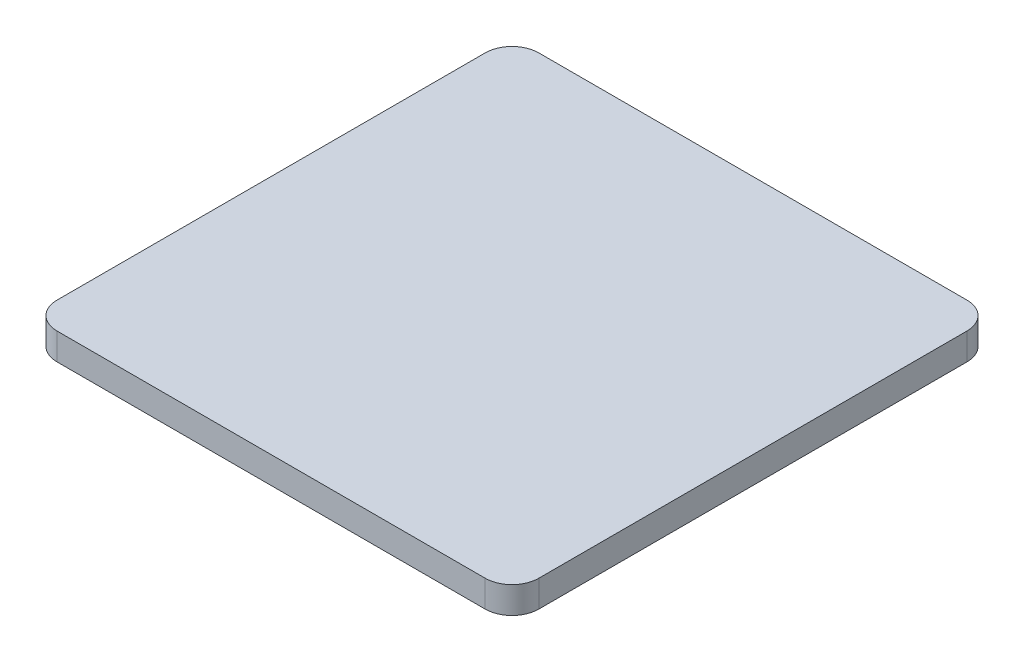
ISO-10303-21;
HEADER;
FILE_DESCRIPTION(('STEP AP214'),'2;1');
FILE_NAME('part.step','',(''),(''),'','','');
FILE_SCHEMA(('AUTOMOTIVE_DESIGN { 1 0 10303 214 1 1 1 1 }'));
ENDSEC;
DATA;
#1=APPLICATION_CONTEXT('core data for automotive mechanical design processes');
#2=APPLICATION_PROTOCOL_DEFINITION('international standard','automotive_design',2000,#1);
#3=PRODUCT_CONTEXT('',#1,'mechanical');
#4=PRODUCT('Part','Part','',(#3));
#5=PRODUCT_RELATED_PRODUCT_CATEGORY('part','',(#4));
#6=PRODUCT_DEFINITION_FORMATION('','',#4);
#7=PRODUCT_DEFINITION_CONTEXT('part definition',#1,'design');
#8=PRODUCT_DEFINITION('design','',#6,#7);
#9=PRODUCT_DEFINITION_SHAPE('','',#8);
#10=(LENGTH_UNIT() NAMED_UNIT(*) SI_UNIT(.MILLI.,.METRE.));
#11=(NAMED_UNIT(*) PLANE_ANGLE_UNIT() SI_UNIT($,.RADIAN.));
#12=(NAMED_UNIT(*) SI_UNIT($,.STERADIAN.) SOLID_ANGLE_UNIT());
#13=UNCERTAINTY_MEASURE_WITH_UNIT(LENGTH_MEASURE(1.E-05),#10,'distance_accuracy_value','');
#14=(GEOMETRIC_REPRESENTATION_CONTEXT(3) GLOBAL_UNCERTAINTY_ASSIGNED_CONTEXT((#13)) GLOBAL_UNIT_ASSIGNED_CONTEXT((#10,
#11,#12)) REPRESENTATION_CONTEXT('',''));
#15=CARTESIAN_POINT('',(0.,0.,0.));
#16=DIRECTION('',(0.,0.,1.));
#17=DIRECTION('',(1.,0.,0.));
#18=AXIS2_PLACEMENT_3D('',#15,#16,#17);
#19=CARTESIAN_POINT('',(-80.,10.,80.));
#20=DIRECTION('',(0.,-1.,0.));
#21=DIRECTION('',(0.,0.,-1.));
#22=AXIS2_PLACEMENT_3D('',#19,#20,#21);
#23=CYLINDRICAL_SURFACE('',#22,9.99999999999999);
#24=CARTESIAN_POINT('',(-80.,0.,80.));
#25=DIRECTION('',(0.,1.,0.));
#26=DIRECTION('',(0.,0.,-1.));
#27=AXIS2_PLACEMENT_3D('',#24,#25,#26);
#28=CIRCLE('',#27,9.99999999999999);
#29=CARTESIAN_POINT('',(-90.,0.,80.));
#30=VERTEX_POINT('',#29);
#31=CARTESIAN_POINT('',(-80.,0.,90.));
#32=VERTEX_POINT('',#31);
#33=EDGE_CURVE('E135',#30,#32,#28,.T.);
#34=ORIENTED_EDGE('',*,*,#33,.T.);
#35=DIRECTION('',(0.,-1.,0.));
#36=VECTOR('',#35,1.);
#37=CARTESIAN_POINT('',(-80.,10.,90.));
#38=LINE('',#37,#36);
#39=CARTESIAN_POINT('',(-80.,10.,90.));
#40=VERTEX_POINT('',#39);
#41=EDGE_CURVE('E11',#40,#32,#38,.T.);
#42=ORIENTED_EDGE('',*,*,#41,.F.);
#43=CARTESIAN_POINT('',(-80.,10.,80.));
#44=DIRECTION('',(0.,1.,0.));
#45=DIRECTION('',(0.,0.,-1.));
#46=AXIS2_PLACEMENT_3D('',#43,#44,#45);
#47=CIRCLE('',#46,9.99999999999999);
#48=CARTESIAN_POINT('',(-90.,10.,80.));
#49=VERTEX_POINT('',#48);
#50=EDGE_CURVE('E149',#49,#40,#47,.T.);
#51=ORIENTED_EDGE('',*,*,#50,.F.);
#52=DIRECTION('',(0.,-1.,0.));
#53=VECTOR('',#52,1.);
#54=CARTESIAN_POINT('',(-90.,10.,80.));
#55=LINE('',#54,#53);
#56=EDGE_CURVE('E131',#49,#30,#55,.T.);
#57=ORIENTED_EDGE('',*,*,#56,.T.);
#58=EDGE_LOOP('',(#34,#42,#51,#57));
#59=FACE_BOUND('',#58,.T.);
#60=ADVANCED_FACE('F39',(#59),#23,.T.);
#61=CARTESIAN_POINT('',(-80.,10.,90.));
#62=DIRECTION('',(0.,0.,-1.));
#63=DIRECTION('',(-1.,0.,0.));
#64=AXIS2_PLACEMENT_3D('',#61,#62,#63);
#65=PLANE('',#64);
#66=DIRECTION('',(1.,0.,0.));
#67=VECTOR('',#66,1.);
#68=CARTESIAN_POINT('',(-80.,0.,90.));
#69=LINE('',#68,#67);
#70=CARTESIAN_POINT('',(80.,0.,90.));
#71=VERTEX_POINT('',#70);
#72=EDGE_CURVE('E138',#32,#71,#69,.T.);
#73=ORIENTED_EDGE('',*,*,#72,.T.);
#74=DIRECTION('',(0.,-1.,0.));
#75=VECTOR('',#74,1.);
#76=CARTESIAN_POINT('',(80.,10.,90.));
#77=LINE('',#76,#75);
#78=CARTESIAN_POINT('',(80.,10.,90.));
#79=VERTEX_POINT('',#78);
#80=EDGE_CURVE('E47',#79,#71,#77,.T.);
#81=ORIENTED_EDGE('',*,*,#80,.F.);
#82=DIRECTION('',(1.,0.,0.));
#83=VECTOR('',#82,1.);
#84=CARTESIAN_POINT('',(-80.,10.,90.));
#85=LINE('',#84,#83);
#86=EDGE_CURVE('E98',#40,#79,#85,.T.);
#87=ORIENTED_EDGE('',*,*,#86,.F.);
#88=ORIENTED_EDGE('',*,*,#41,.T.);
#89=EDGE_LOOP('',(#73,#81,#87,#88));
#90=FACE_BOUND('',#89,.T.);
#91=ADVANCED_FACE('F184',(#90),#65,.F.);
#92=CARTESIAN_POINT('',(80.,10.,80.));
#93=DIRECTION('',(0.,-1.,0.));
#94=DIRECTION('',(0.,0.,-1.));
#95=AXIS2_PLACEMENT_3D('',#92,#93,#94);
#96=CYLINDRICAL_SURFACE('',#95,9.99999999999999);
#97=CARTESIAN_POINT('',(80.,0.,80.));
#98=DIRECTION('',(0.,1.,0.));
#99=DIRECTION('',(0.,0.,1.));
#100=AXIS2_PLACEMENT_3D('',#97,#98,#99);
#101=CIRCLE('',#100,9.99999999999999);
#102=CARTESIAN_POINT('',(90.,0.,80.));
#103=VERTEX_POINT('',#102);
#104=EDGE_CURVE('E140',#71,#103,#101,.T.);
#105=ORIENTED_EDGE('',*,*,#104,.T.);
#106=DIRECTION('',(0.,-1.,0.));
#107=VECTOR('',#106,1.);
#108=CARTESIAN_POINT('',(90.,10.,80.));
#109=LINE('',#108,#107);
#110=CARTESIAN_POINT('',(90.,10.,80.));
#111=VERTEX_POINT('',#110);
#112=EDGE_CURVE('E156',#111,#103,#109,.T.);
#113=ORIENTED_EDGE('',*,*,#112,.F.);
#114=CARTESIAN_POINT('',(80.,10.,80.));
#115=DIRECTION('',(0.,1.,0.));
#116=DIRECTION('',(0.,0.,1.));
#117=AXIS2_PLACEMENT_3D('',#114,#115,#116);
#118=CIRCLE('',#117,9.99999999999999);
#119=EDGE_CURVE('E164',#79,#111,#118,.T.);
#120=ORIENTED_EDGE('',*,*,#119,.F.);
#121=ORIENTED_EDGE('',*,*,#80,.T.);
#122=EDGE_LOOP('',(#105,#113,#120,#121));
#123=FACE_BOUND('',#122,.T.);
#124=ADVANCED_FACE('F162',(#123),#96,.T.);
#125=CARTESIAN_POINT('',(90.,10.,80.));
#126=DIRECTION('',(-1.,0.,0.));
#127=DIRECTION('',(0.,0.,1.));
#128=AXIS2_PLACEMENT_3D('',#125,#126,#127);
#129=PLANE('',#128);
#130=DIRECTION('',(0.,0.,-1.));
#131=VECTOR('',#130,1.);
#132=CARTESIAN_POINT('',(90.,0.,80.));
#133=LINE('',#132,#131);
#134=CARTESIAN_POINT('',(90.,0.,-80.));
#135=VERTEX_POINT('',#134);
#136=EDGE_CURVE('E142',#103,#135,#133,.T.);
#137=ORIENTED_EDGE('',*,*,#136,.T.);
#138=DIRECTION('',(0.,-1.,0.));
#139=VECTOR('',#138,1.);
#140=CARTESIAN_POINT('',(90.,10.,-80.));
#141=LINE('',#140,#139);
#142=CARTESIAN_POINT('',(90.,10.,-80.));
#143=VERTEX_POINT('',#142);
#144=EDGE_CURVE('E153',#143,#135,#141,.T.);
#145=ORIENTED_EDGE('',*,*,#144,.F.);
#146=DIRECTION('',(0.,0.,-1.));
#147=VECTOR('',#146,1.);
#148=CARTESIAN_POINT('',(90.,10.,80.));
#149=LINE('',#148,#147);
#150=EDGE_CURVE('E176',#111,#143,#149,.T.);
#151=ORIENTED_EDGE('',*,*,#150,.F.);
#152=ORIENTED_EDGE('',*,*,#112,.T.);
#153=EDGE_LOOP('',(#137,#145,#151,#152));
#154=FACE_BOUND('',#153,.T.);
#155=ADVANCED_FACE('F172',(#154),#129,.F.);
#156=CARTESIAN_POINT('',(80.,10.,-80.));
#157=DIRECTION('',(0.,-1.,0.));
#158=DIRECTION('',(0.,0.,-1.));
#159=AXIS2_PLACEMENT_3D('',#156,#157,#158);
#160=CYLINDRICAL_SURFACE('',#159,9.99999999999999);
#161=CARTESIAN_POINT('',(80.,0.,-80.));
#162=DIRECTION('',(0.,1.,0.));
#163=DIRECTION('',(0.,0.,-1.));
#164=AXIS2_PLACEMENT_3D('',#161,#162,#163);
#165=CIRCLE('',#164,9.99999999999999);
#166=CARTESIAN_POINT('',(80.,0.,-90.));
#167=VERTEX_POINT('',#166);
#168=EDGE_CURVE('E144',#135,#167,#165,.T.);
#169=ORIENTED_EDGE('',*,*,#168,.T.);
#170=DIRECTION('',(0.,-1.,0.));
#171=VECTOR('',#170,1.);
#172=CARTESIAN_POINT('',(80.,10.,-90.));
#173=LINE('',#172,#171);
#174=CARTESIAN_POINT('',(80.,10.,-90.));
#175=VERTEX_POINT('',#174);
#176=EDGE_CURVE('E126',#175,#167,#173,.T.);
#177=ORIENTED_EDGE('',*,*,#176,.F.);
#178=CARTESIAN_POINT('',(80.,10.,-80.));
#179=DIRECTION('',(0.,1.,0.));
#180=DIRECTION('',(0.,0.,-1.));
#181=AXIS2_PLACEMENT_3D('',#178,#179,#180);
#182=CIRCLE('',#181,9.99999999999999);
#183=EDGE_CURVE('E117',#143,#175,#182,.T.);
#184=ORIENTED_EDGE('',*,*,#183,.F.);
#185=ORIENTED_EDGE('',*,*,#144,.T.);
#186=EDGE_LOOP('',(#169,#177,#184,#185));
#187=FACE_BOUND('',#186,.T.);
#188=ADVANCED_FACE('F175',(#187),#160,.T.);
#189=CARTESIAN_POINT('',(-80.,10.,-90.));
#190=DIRECTION('',(0.,0.,1.));
#191=DIRECTION('',(1.,0.,0.));
#192=AXIS2_PLACEMENT_3D('',#189,#190,#191);
#193=PLANE('',#192);
#194=DIRECTION('',(-1.,0.,0.));
#195=VECTOR('',#194,1.);
#196=CARTESIAN_POINT('',(-80.,0.,-90.));
#197=LINE('',#196,#195);
#198=CARTESIAN_POINT('',(-80.,0.,-90.));
#199=VERTEX_POINT('',#198);
#200=EDGE_CURVE('E125',#167,#199,#197,.T.);
#201=ORIENTED_EDGE('',*,*,#200,.T.);
#202=DIRECTION('',(0.,-1.,0.));
#203=VECTOR('',#202,1.);
#204=CARTESIAN_POINT('',(-80.,10.,-90.));
#205=LINE('',#204,#203);
#206=CARTESIAN_POINT('',(-80.,10.,-90.));
#207=VERTEX_POINT('',#206);
#208=EDGE_CURVE('E122',#207,#199,#205,.T.);
#209=ORIENTED_EDGE('',*,*,#208,.F.);
#210=DIRECTION('',(-1.,0.,0.));
#211=VECTOR('',#210,1.);
#212=CARTESIAN_POINT('',(-80.,10.,-90.));
#213=LINE('',#212,#211);
#214=EDGE_CURVE('E111',#175,#207,#213,.T.);
#215=ORIENTED_EDGE('',*,*,#214,.F.);
#216=ORIENTED_EDGE('',*,*,#176,.T.);
#217=EDGE_LOOP('',(#201,#209,#215,#216));
#218=FACE_BOUND('',#217,.T.);
#219=ADVANCED_FACE('F123',(#218),#193,.F.);
#220=CARTESIAN_POINT('',(-80.,10.,-80.));
#221=DIRECTION('',(0.,-1.,0.));
#222=DIRECTION('',(0.,0.,-1.));
#223=AXIS2_PLACEMENT_3D('',#220,#221,#222);
#224=CYLINDRICAL_SURFACE('',#223,9.99999999999999);
#225=CARTESIAN_POINT('',(-80.,0.,-80.));
#226=DIRECTION('',(0.,1.,0.));
#227=DIRECTION('',(0.,0.,-1.));
#228=AXIS2_PLACEMENT_3D('',#225,#226,#227);
#229=CIRCLE('',#228,9.99999999999999);
#230=CARTESIAN_POINT('',(-90.,0.,-80.));
#231=VERTEX_POINT('',#230);
#232=EDGE_CURVE('E84',#199,#231,#229,.T.);
#233=ORIENTED_EDGE('',*,*,#232,.T.);
#234=DIRECTION('',(0.,-1.,0.));
#235=VECTOR('',#234,1.);
#236=CARTESIAN_POINT('',(-90.,10.,-80.));
#237=LINE('',#236,#235);
#238=CARTESIAN_POINT('',(-90.,10.,-80.));
#239=VERTEX_POINT('',#238);
#240=EDGE_CURVE('E127',#239,#231,#237,.T.);
#241=ORIENTED_EDGE('',*,*,#240,.F.);
#242=CARTESIAN_POINT('',(-80.,10.,-80.));
#243=DIRECTION('',(0.,1.,0.));
#244=DIRECTION('',(0.,0.,-1.));
#245=AXIS2_PLACEMENT_3D('',#242,#243,#244);
#246=CIRCLE('',#245,9.99999999999999);
#247=EDGE_CURVE('E115',#207,#239,#246,.T.);
#248=ORIENTED_EDGE('',*,*,#247,.F.);
#249=ORIENTED_EDGE('',*,*,#208,.T.);
#250=EDGE_LOOP('',(#233,#241,#248,#249));
#251=FACE_BOUND('',#250,.T.);
#252=ADVANCED_FACE('F129',(#251),#224,.T.);
#253=CARTESIAN_POINT('',(-90.,10.,80.));
#254=DIRECTION('',(1.,0.,0.));
#255=DIRECTION('',(0.,0.,-1.));
#256=AXIS2_PLACEMENT_3D('',#253,#254,#255);
#257=PLANE('',#256);
#258=DIRECTION('',(0.,0.,1.));
#259=VECTOR('',#258,1.);
#260=CARTESIAN_POINT('',(-90.,0.,80.));
#261=LINE('',#260,#259);
#262=EDGE_CURVE('E90',#231,#30,#261,.T.);
#263=ORIENTED_EDGE('',*,*,#262,.T.);
#264=ORIENTED_EDGE('',*,*,#56,.F.);
#265=DIRECTION('',(0.,0.,1.));
#266=VECTOR('',#265,1.);
#267=CARTESIAN_POINT('',(-90.,10.,80.));
#268=LINE('',#267,#266);
#269=EDGE_CURVE('E55',#239,#49,#268,.T.);
#270=ORIENTED_EDGE('',*,*,#269,.F.);
#271=ORIENTED_EDGE('',*,*,#240,.T.);
#272=EDGE_LOOP('',(#263,#264,#270,#271));
#273=FACE_BOUND('',#272,.T.);
#274=ADVANCED_FACE('F200',(#273),#257,.F.);
#275=CARTESIAN_POINT('',(-80.,10.,80.));
#276=DIRECTION('',(0.,-1.,0.));
#277=DIRECTION('',(0.,0.,-1.));
#278=AXIS2_PLACEMENT_3D('',#275,#276,#277);
#279=PLANE('',#278);
#280=ORIENTED_EDGE('',*,*,#50,.T.);
#281=ORIENTED_EDGE('',*,*,#86,.T.);
#282=ORIENTED_EDGE('',*,*,#119,.T.);
#283=ORIENTED_EDGE('',*,*,#150,.T.);
#284=ORIENTED_EDGE('',*,*,#183,.T.);
#285=ORIENTED_EDGE('',*,*,#214,.T.);
#286=ORIENTED_EDGE('',*,*,#247,.T.);
#287=ORIENTED_EDGE('',*,*,#269,.T.);
#288=EDGE_LOOP('',(#280,#281,#282,#283,#284,#285,#286,#287));
#289=FACE_BOUND('',#288,.T.);
#290=ADVANCED_FACE('F113',(#289),#279,.F.);
#291=CARTESIAN_POINT('',(-80.,0.,80.));
#292=DIRECTION('',(0.,-1.,0.));
#293=DIRECTION('',(0.,0.,-1.));
#294=AXIS2_PLACEMENT_3D('',#291,#292,#293);
#295=PLANE('',#294);
#296=ORIENTED_EDGE('',*,*,#33,.F.);
#297=ORIENTED_EDGE('',*,*,#262,.F.);
#298=ORIENTED_EDGE('',*,*,#232,.F.);
#299=ORIENTED_EDGE('',*,*,#200,.F.);
#300=ORIENTED_EDGE('',*,*,#168,.F.);
#301=ORIENTED_EDGE('',*,*,#136,.F.);
#302=ORIENTED_EDGE('',*,*,#104,.F.);
#303=ORIENTED_EDGE('',*,*,#72,.F.);
#304=EDGE_LOOP('',(#296,#297,#298,#299,#300,#301,#302,#303));
#305=FACE_BOUND('',#304,.T.);
#306=ADVANCED_FACE('F168',(#305),#295,.T.);
#307=CLOSED_SHELL('',(#60,#91,#124,#155,#188,#219,#252,#274,#290,#306));
#308=MANIFOLD_SOLID_BREP('B2',#307);
#309=ADVANCED_BREP_SHAPE_REPRESENTATION('',(#18,#308),#14);
#310=SHAPE_DEFINITION_REPRESENTATION(#9,#309);
ENDSEC;
END-ISO-10303-21;
